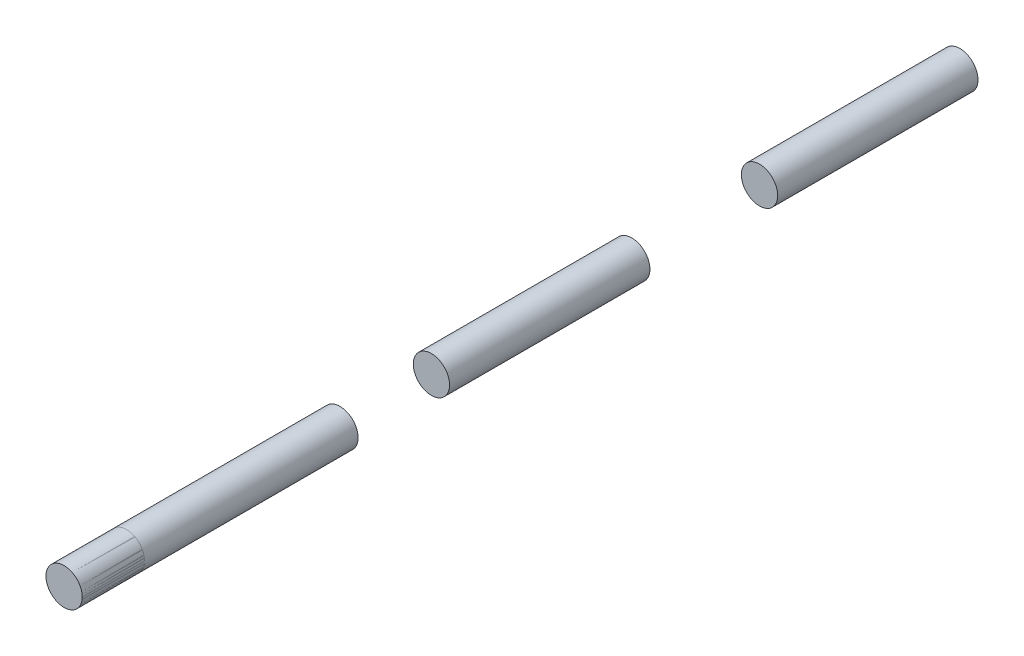
ISO-10303-21;
HEADER;
FILE_DESCRIPTION(('STEP AP214'),'2;1');
FILE_NAME('part.step','',(''),(''),'','','');
FILE_SCHEMA(('AUTOMOTIVE_DESIGN { 1 0 10303 214 1 1 1 1 }'));
ENDSEC;
DATA;
#1=APPLICATION_CONTEXT('core data for automotive mechanical design processes');
#2=APPLICATION_PROTOCOL_DEFINITION('international standard','automotive_design',2000,#1);
#3=PRODUCT_CONTEXT('',#1,'mechanical');
#4=PRODUCT('Part','Part','',(#3));
#5=PRODUCT_RELATED_PRODUCT_CATEGORY('part','',(#4));
#6=PRODUCT_DEFINITION_FORMATION('','',#4);
#7=PRODUCT_DEFINITION_CONTEXT('part definition',#1,'design');
#8=PRODUCT_DEFINITION('design','',#6,#7);
#9=PRODUCT_DEFINITION_SHAPE('','',#8);
#10=(LENGTH_UNIT() NAMED_UNIT(*) SI_UNIT(.MILLI.,.METRE.));
#11=(NAMED_UNIT(*) PLANE_ANGLE_UNIT() SI_UNIT($,.RADIAN.));
#12=(NAMED_UNIT(*) SI_UNIT($,.STERADIAN.) SOLID_ANGLE_UNIT());
#13=UNCERTAINTY_MEASURE_WITH_UNIT(LENGTH_MEASURE(1.E-05),#10,'distance_accuracy_value','');
#14=(GEOMETRIC_REPRESENTATION_CONTEXT(3) GLOBAL_UNCERTAINTY_ASSIGNED_CONTEXT((#13)) GLOBAL_UNIT_ASSIGNED_CONTEXT((#10,
#11,#12)) REPRESENTATION_CONTEXT('',''));
#15=CARTESIAN_POINT('',(0.,0.,0.));
#16=DIRECTION('',(0.,0.,1.));
#17=DIRECTION('',(1.,0.,0.));
#18=AXIS2_PLACEMENT_3D('',#15,#16,#17);
#19=CARTESIAN_POINT('',(0.,-1.054232185802E-13,308.536512242138));
#20=DIRECTION('',(0.,0.,-1.));
#21=DIRECTION('',(-1.,0.,0.));
#22=AXIS2_PLACEMENT_3D('',#19,#20,#21);
#23=CYLINDRICAL_SURFACE('',#22,6.35);
#24=CARTESIAN_POINT('',(0.,-1.054232185802E-13,194.056));
#25=DIRECTION('',(0.,0.,1.));
#26=DIRECTION('',(1.,0.,0.));
#27=AXIS2_PLACEMENT_3D('',#24,#25,#26);
#28=CIRCLE('',#27,6.35);
#29=CARTESIAN_POINT('',(6.34999999999991,-1.054232185802E-13,194.056));
#30=VERTEX_POINT('',#29);
#31=EDGE_CURVE('E53',#30,#30,#28,.T.);
#32=ORIENTED_EDGE('',*,*,#31,.T.);
#33=EDGE_LOOP('',(#32));
#34=FACE_BOUND('',#33,.T.);
#35=CARTESIAN_POINT('',(0.,-1.054232185802E-13,290.576));
#36=DIRECTION('',(0.,0.,1.));
#37=DIRECTION('',(1.,0.,0.));
#38=AXIS2_PLACEMENT_3D('',#35,#36,#37);
#39=CIRCLE('',#38,6.35);
#40=CARTESIAN_POINT('',(6.34999999999991,-1.054232185802E-13,290.576));
#41=VERTEX_POINT('',#40);
#42=EDGE_CURVE('E11',#41,#41,#39,.T.);
#43=ORIENTED_EDGE('',*,*,#42,.F.);
#44=EDGE_LOOP('',(#43));
#45=FACE_BOUND('',#44,.T.);
#46=ADVANCED_FACE('F46',(#34,#45),#23,.T.);
#47=CARTESIAN_POINT('',(0.,-1.054232185802E-13,194.056));
#48=DIRECTION('',(0.,0.,1.));
#49=DIRECTION('',(1.,0.,0.));
#50=AXIS2_PLACEMENT_3D('',#47,#48,#49);
#51=PLANE('',#50);
#52=ORIENTED_EDGE('',*,*,#31,.F.);
#53=EDGE_LOOP('',(#52));
#54=FACE_BOUND('',#53,.T.);
#55=ADVANCED_FACE('F61',(#54),#51,.F.);
#56=CARTESIAN_POINT('',(0.,0.,290.576));
#57=DIRECTION('',(0.,0.,1.));
#58=DIRECTION('',(1.,0.,0.));
#59=AXIS2_PLACEMENT_3D('',#56,#57,#58);
#60=PLANE('',#59);
#61=ORIENTED_EDGE('',*,*,#42,.T.);
#62=EDGE_LOOP('',(#61));
#63=FACE_BOUND('',#62,.T.);
#64=ADVANCED_FACE('F48',(#63),#60,.T.);
#65=CLOSED_SHELL('',(#46,#55,#64));
#66=MANIFOLD_SOLID_BREP('B2',#65);
#67=CARTESIAN_POINT('',(0.,0.,280.162));
#68=DIRECTION('',(0.,0.,1.));
#69=DIRECTION('',(1.,0.,0.));
#70=AXIS2_PLACEMENT_3D('',#67,#68,#69);
#71=CYLINDRICAL_SURFACE('',#70,6.35);
#72=CARTESIAN_POINT('',(0.,0.,268.732));
#73=DIRECTION('',(0.,0.,1.));
#74=DIRECTION('',(1.,0.,0.));
#75=AXIS2_PLACEMENT_3D('',#72,#73,#74);
#76=CIRCLE('',#75,6.35);
#77=CARTESIAN_POINT('',(6.34999999999993,0.,268.732));
#78=VERTEX_POINT('',#77);
#79=EDGE_CURVE('E99',#78,#78,#76,.T.);
#80=ORIENTED_EDGE('',*,*,#79,.F.);
#81=EDGE_LOOP('',(#80));
#82=FACE_BOUND('',#81,.T.);
#83=CARTESIAN_POINT('',(0.,0.,290.576));
#84=DIRECTION('',(0.,0.,1.));
#85=DIRECTION('',(1.,0.,0.));
#86=AXIS2_PLACEMENT_3D('',#83,#84,#85);
#87=CIRCLE('',#86,6.35);
#88=CARTESIAN_POINT('',(6.34999999999994,0.,290.576));
#89=VERTEX_POINT('',#88);
#90=EDGE_CURVE('E45',#89,#89,#87,.F.);
#91=ORIENTED_EDGE('',*,*,#90,.F.);
#92=EDGE_LOOP('',(#91));
#93=FACE_BOUND('',#92,.T.);
#94=ADVANCED_FACE('F95',(#82,#93),#71,.F.);
#95=OPEN_SHELL('',(#94));
#96=SHELL_BASED_SURFACE_MODEL('B6',(#95));
#97=CARTESIAN_POINT('',(0.,-1.08222760521358E-13,205.486));
#98=DIRECTION('',(0.,0.,-1.));
#99=DIRECTION('',(1.,0.,0.));
#100=AXIS2_PLACEMENT_3D('',#97,#98,#99);
#101=CYLINDRICAL_SURFACE('',#100,6.35);
#102=CARTESIAN_POINT('',(0.,-1.11022302462516E-13,216.916));
#103=DIRECTION('',(0.,0.,-1.));
#104=DIRECTION('',(1.,0.,0.));
#105=AXIS2_PLACEMENT_3D('',#102,#103,#104);
#106=CIRCLE('',#105,6.35);
#107=CARTESIAN_POINT('',(6.34999999999991,-1.09984254497667E-13,216.916));
#108=VERTEX_POINT('',#107);
#109=EDGE_CURVE('E132',#108,#108,#106,.T.);
#110=ORIENTED_EDGE('',*,*,#109,.F.);
#111=EDGE_LOOP('',(#110));
#112=FACE_BOUND('',#111,.T.);
#113=CARTESIAN_POINT('',(0.,-1.054232185802E-13,194.056));
#114=DIRECTION('',(0.,0.,-1.));
#115=DIRECTION('',(1.,0.,0.));
#116=AXIS2_PLACEMENT_3D('',#113,#114,#115);
#117=CIRCLE('',#116,6.35);
#118=CARTESIAN_POINT('',(6.34999999999991,-1.04385170615352E-13,194.056));
#119=VERTEX_POINT('',#118);
#120=EDGE_CURVE('E94',#119,#119,#117,.F.);
#121=ORIENTED_EDGE('',*,*,#120,.F.);
#122=EDGE_LOOP('',(#121));
#123=FACE_BOUND('',#122,.T.);
#124=ADVANCED_FACE('F128',(#112,#123),#101,.F.);
#125=OPEN_SHELL('',(#124));
#126=SHELL_BASED_SURFACE_MODEL('B40',(#125));
#127=CARTESIAN_POINT('',(1.78438874594201E-13,0.,180.012512242138));
#128=DIRECTION('',(0.,0.,-1.));
#129=DIRECTION('',(-1.,0.,0.));
#130=AXIS2_PLACEMENT_3D('',#127,#128,#129);
#131=CYLINDRICAL_SURFACE('',#130,6.35);
#132=CARTESIAN_POINT('',(1.78438874594201E-13,0.,91.948));
#133=DIRECTION('',(0.,0.,1.));
#134=DIRECTION('',(1.,0.,0.));
#135=AXIS2_PLACEMENT_3D('',#132,#133,#134);
#136=CIRCLE('',#135,6.35);
#137=CARTESIAN_POINT('',(6.35000000000018,0.,91.948));
#138=VERTEX_POINT('',#137);
#139=EDGE_CURVE('E180',#138,#138,#136,.T.);
#140=ORIENTED_EDGE('',*,*,#139,.T.);
#141=EDGE_LOOP('',(#140));
#142=FACE_BOUND('',#141,.T.);
#143=CARTESIAN_POINT('',(1.78438874594201E-13,0.,162.052));
#144=DIRECTION('',(0.,0.,1.));
#145=DIRECTION('',(1.,0.,0.));
#146=AXIS2_PLACEMENT_3D('',#143,#144,#145);
#147=CIRCLE('',#146,6.35);
#148=CARTESIAN_POINT('',(6.35000000000018,0.,162.052));
#149=VERTEX_POINT('',#148);
#150=EDGE_CURVE('E127',#149,#149,#147,.T.);
#151=ORIENTED_EDGE('',*,*,#150,.F.);
#152=EDGE_LOOP('',(#151));
#153=FACE_BOUND('',#152,.T.);
#154=ADVANCED_FACE('F173',(#142,#153),#131,.T.);
#155=CARTESIAN_POINT('',(1.78438874594201E-13,0.,91.948));
#156=DIRECTION('',(0.,0.,1.));
#157=DIRECTION('',(1.,0.,0.));
#158=AXIS2_PLACEMENT_3D('',#155,#156,#157);
#159=PLANE('',#158);
#160=ORIENTED_EDGE('',*,*,#139,.F.);
#161=EDGE_LOOP('',(#160));
#162=FACE_BOUND('',#161,.T.);
#163=ADVANCED_FACE('F188',(#162),#159,.F.);
#164=CARTESIAN_POINT('',(0.,0.,162.052));
#165=DIRECTION('',(0.,0.,1.));
#166=DIRECTION('',(1.,0.,0.));
#167=AXIS2_PLACEMENT_3D('',#164,#165,#166);
#168=PLANE('',#167);
#169=ORIENTED_EDGE('',*,*,#150,.T.);
#170=EDGE_LOOP('',(#169));
#171=FACE_BOUND('',#170,.T.);
#172=ADVANCED_FACE('F175',(#171),#168,.T.);
#173=CLOSED_SHELL('',(#154,#163,#172));
#174=MANIFOLD_SOLID_BREP('B89',#173);
#175=CARTESIAN_POINT('',(0.,0.,65.2045122421383));
#176=DIRECTION('',(0.,0.,-1.));
#177=DIRECTION('',(-1.,0.,0.));
#178=AXIS2_PLACEMENT_3D('',#175,#176,#177);
#179=CYLINDRICAL_SURFACE('',#178,6.35);
#180=CARTESIAN_POINT('',(0.,0.,-22.86));
#181=DIRECTION('',(0.,0.,1.));
#182=DIRECTION('',(1.,0.,0.));
#183=AXIS2_PLACEMENT_3D('',#180,#181,#182);
#184=CIRCLE('',#183,6.35);
#185=CARTESIAN_POINT('',(6.35,0.,-22.86));
#186=VERTEX_POINT('',#185);
#187=EDGE_CURVE('E309',#186,#186,#184,.T.);
#188=ORIENTED_EDGE('',*,*,#187,.T.);
#189=EDGE_LOOP('',(#188));
#190=FACE_BOUND('',#189,.T.);
#191=CARTESIAN_POINT('',(0.,0.,47.244));
#192=DIRECTION('',(0.,0.,1.));
#193=DIRECTION('',(1.,0.,0.));
#194=AXIS2_PLACEMENT_3D('',#191,#192,#193);
#195=CIRCLE('',#194,6.35);
#196=CARTESIAN_POINT('',(6.35,0.,47.244));
#197=VERTEX_POINT('',#196);
#198=EDGE_CURVE('E254',#197,#197,#195,.T.);
#199=ORIENTED_EDGE('',*,*,#198,.F.);
#200=EDGE_LOOP('',(#199));
#201=FACE_BOUND('',#200,.T.);
#202=ADVANCED_FACE('F302',(#190,#201),#179,.T.);
#203=CARTESIAN_POINT('',(0.,0.,-22.86));
#204=DIRECTION('',(0.,0.,1.));
#205=DIRECTION('',(1.,0.,0.));
#206=AXIS2_PLACEMENT_3D('',#203,#204,#205);
#207=PLANE('',#206);
#208=ORIENTED_EDGE('',*,*,#187,.F.);
#209=EDGE_LOOP('',(#208));
#210=FACE_BOUND('',#209,.T.);
#211=ADVANCED_FACE('F317',(#210),#207,.F.);
#212=CARTESIAN_POINT('',(0.,0.,47.244));
#213=DIRECTION('',(0.,0.,1.));
#214=DIRECTION('',(1.,0.,0.));
#215=AXIS2_PLACEMENT_3D('',#212,#213,#214);
#216=PLANE('',#215);
#217=ORIENTED_EDGE('',*,*,#198,.T.);
#218=EDGE_LOOP('',(#217));
#219=FACE_BOUND('',#218,.T.);
#220=ADVANCED_FACE('F304',(#219),#216,.T.);
#221=CLOSED_SHELL('',(#202,#211,#220));
#222=MANIFOLD_SOLID_BREP('B216',#221);
#223=ADVANCED_BREP_SHAPE_REPRESENTATION('',(#18,#66,#174,#222),#14);
#224=MANIFOLD_SURFACE_SHAPE_REPRESENTATION('',(#18,#96,#126),#14);
#225=SHAPE_REPRESENTATION('',(#18),#14);
#226=SHAPE_DEFINITION_REPRESENTATION(#9,#225);
#227=SHAPE_REPRESENTATION_RELATIONSHIP('','',#225,#223);
#228=SHAPE_REPRESENTATION_RELATIONSHIP('','',#225,#224);
ENDSEC;
END-ISO-10303-21;
